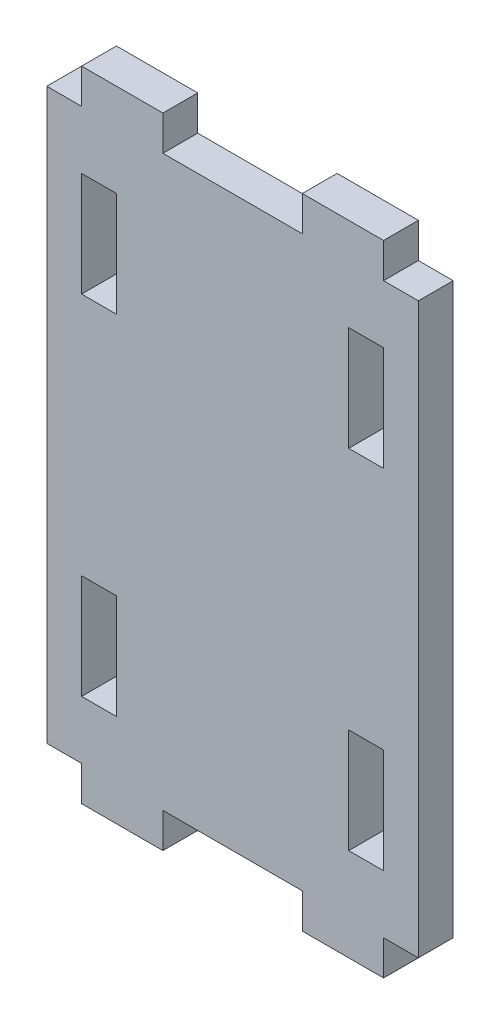
ISO-10303-21;
HEADER;
FILE_DESCRIPTION(('STEP AP214'),'2;1');
FILE_NAME('part.step','',(''),(''),'','','');
FILE_SCHEMA(('AUTOMOTIVE_DESIGN { 1 0 10303 214 1 1 1 1 }'));
ENDSEC;
DATA;
#1=APPLICATION_CONTEXT('core data for automotive mechanical design processes');
#2=APPLICATION_PROTOCOL_DEFINITION('international standard','automotive_design',2000,#1);
#3=PRODUCT_CONTEXT('',#1,'mechanical');
#4=PRODUCT('Part','Part','',(#3));
#5=PRODUCT_RELATED_PRODUCT_CATEGORY('part','',(#4));
#6=PRODUCT_DEFINITION_FORMATION('','',#4);
#7=PRODUCT_DEFINITION_CONTEXT('part definition',#1,'design');
#8=PRODUCT_DEFINITION('design','',#6,#7);
#9=PRODUCT_DEFINITION_SHAPE('','',#8);
#10=(LENGTH_UNIT() NAMED_UNIT(*) SI_UNIT(.MILLI.,.METRE.));
#11=(NAMED_UNIT(*) PLANE_ANGLE_UNIT() SI_UNIT($,.RADIAN.));
#12=(NAMED_UNIT(*) SI_UNIT($,.STERADIAN.) SOLID_ANGLE_UNIT());
#13=UNCERTAINTY_MEASURE_WITH_UNIT(LENGTH_MEASURE(1.E-05),#10,'distance_accuracy_value','');
#14=(GEOMETRIC_REPRESENTATION_CONTEXT(3) GLOBAL_UNCERTAINTY_ASSIGNED_CONTEXT((#13)) GLOBAL_UNIT_ASSIGNED_CONTEXT((#10,
#11,#12)) REPRESENTATION_CONTEXT('',''));
#15=CARTESIAN_POINT('',(0.,0.,0.));
#16=DIRECTION('',(0.,0.,1.));
#17=DIRECTION('',(1.,0.,0.));
#18=AXIS2_PLACEMENT_3D('',#15,#16,#17);
#19=CARTESIAN_POINT('',(0.,0.,3.));
#20=DIRECTION('',(1.,0.,0.));
#21=DIRECTION('',(0.,0.,-1.));
#22=AXIS2_PLACEMENT_3D('',#19,#20,#21);
#23=PLANE('',#22);
#24=DIRECTION('',(0.,0.,1.));
#25=VECTOR('',#24,1.);
#26=CARTESIAN_POINT('',(0.,3.,0.));
#27=LINE('',#26,#25);
#28=CARTESIAN_POINT('',(0.,3.,0.));
#29=VERTEX_POINT('',#28);
#30=CARTESIAN_POINT('',(0.,3.,3.));
#31=VERTEX_POINT('',#30);
#32=EDGE_CURVE('E476',#29,#31,#27,.T.);
#33=ORIENTED_EDGE('',*,*,#32,.T.);
#34=DIRECTION('',(0.,-1.,0.));
#35=VECTOR('',#34,1.);
#36=CARTESIAN_POINT('',(0.,0.,3.));
#37=LINE('',#36,#35);
#38=CARTESIAN_POINT('',(0.,52.,3.));
#39=VERTEX_POINT('',#38);
#40=EDGE_CURVE('E532',#39,#31,#37,.T.);
#41=ORIENTED_EDGE('',*,*,#40,.F.);
#42=DIRECTION('',(0.,0.,1.));
#43=VECTOR('',#42,1.);
#44=CARTESIAN_POINT('',(0.,52.,0.));
#45=LINE('',#44,#43);
#46=CARTESIAN_POINT('',(0.,52.,0.));
#47=VERTEX_POINT('',#46);
#48=EDGE_CURVE('E528',#47,#39,#45,.T.);
#49=ORIENTED_EDGE('',*,*,#48,.F.);
#50=DIRECTION('',(0.,-1.,0.));
#51=VECTOR('',#50,1.);
#52=CARTESIAN_POINT('',(0.,0.,0.));
#53=LINE('',#52,#51);
#54=EDGE_CURVE('E527',#47,#29,#53,.T.);
#55=ORIENTED_EDGE('',*,*,#54,.T.);
#56=EDGE_LOOP('',(#33,#41,#49,#55));
#57=FACE_BOUND('',#56,.T.);
#58=ADVANCED_FACE('F34',(#57),#23,.F.);
#59=CARTESIAN_POINT('',(0.,0.,3.));
#60=DIRECTION('',(0.,1.,0.));
#61=DIRECTION('',(0.,0.,1.));
#62=AXIS2_PLACEMENT_3D('',#59,#60,#61);
#63=PLANE('',#62);
#64=DIRECTION('',(1.,0.,0.));
#65=VECTOR('',#64,1.);
#66=CARTESIAN_POINT('',(0.,0.,3.));
#67=LINE('',#66,#65);
#68=CARTESIAN_POINT('',(3.,0.,3.));
#69=VERTEX_POINT('',#68);
#70=CARTESIAN_POINT('',(10.,0.,3.));
#71=VERTEX_POINT('',#70);
#72=EDGE_CURVE('E539',#69,#71,#67,.T.);
#73=ORIENTED_EDGE('',*,*,#72,.F.);
#74=DIRECTION('',(0.,0.,1.));
#75=VECTOR('',#74,1.);
#76=CARTESIAN_POINT('',(3.,0.,0.));
#77=LINE('',#76,#75);
#78=CARTESIAN_POINT('',(3.,0.,0.));
#79=VERTEX_POINT('',#78);
#80=EDGE_CURVE('E484',#79,#69,#77,.T.);
#81=ORIENTED_EDGE('',*,*,#80,.F.);
#82=DIRECTION('',(1.,0.,0.));
#83=VECTOR('',#82,1.);
#84=CARTESIAN_POINT('',(0.,0.,0.));
#85=LINE('',#84,#83);
#86=CARTESIAN_POINT('',(10.,0.,0.));
#87=VERTEX_POINT('',#86);
#88=EDGE_CURVE('E548',#79,#87,#85,.T.);
#89=ORIENTED_EDGE('',*,*,#88,.T.);
#90=DIRECTION('',(0.,0.,1.));
#91=VECTOR('',#90,1.);
#92=CARTESIAN_POINT('',(10.,0.,0.));
#93=LINE('',#92,#91);
#94=EDGE_CURVE('E497',#87,#71,#93,.T.);
#95=ORIENTED_EDGE('',*,*,#94,.T.);
#96=EDGE_LOOP('',(#73,#81,#89,#95));
#97=FACE_BOUND('',#96,.T.);
#98=ADVANCED_FACE('F560',(#97),#63,.F.);
#99=CARTESIAN_POINT('',(22.,0.,3.));
#100=VERTEX_POINT('',#99);
#101=CARTESIAN_POINT('',(29.,0.,3.));
#102=VERTEX_POINT('',#101);
#103=EDGE_CURVE('E535',#100,#102,#67,.T.);
#104=ORIENTED_EDGE('',*,*,#103,.F.);
#105=DIRECTION('',(0.,0.,1.));
#106=VECTOR('',#105,1.);
#107=CARTESIAN_POINT('',(22.,0.,0.));
#108=LINE('',#107,#106);
#109=CARTESIAN_POINT('',(22.,0.,0.));
#110=VERTEX_POINT('',#109);
#111=EDGE_CURVE('E509',#110,#100,#108,.T.);
#112=ORIENTED_EDGE('',*,*,#111,.F.);
#113=CARTESIAN_POINT('',(29.,0.,0.));
#114=VERTEX_POINT('',#113);
#115=EDGE_CURVE('E546',#110,#114,#85,.T.);
#116=ORIENTED_EDGE('',*,*,#115,.T.);
#117=DIRECTION('',(0.,0.,1.));
#118=VECTOR('',#117,1.);
#119=CARTESIAN_POINT('',(29.,0.,0.));
#120=LINE('',#119,#118);
#121=EDGE_CURVE('E410',#114,#102,#120,.T.);
#122=ORIENTED_EDGE('',*,*,#121,.T.);
#123=EDGE_LOOP('',(#104,#112,#116,#122));
#124=FACE_BOUND('',#123,.T.);
#125=ADVANCED_FACE('F629',(#124),#63,.F.);
#126=CARTESIAN_POINT('',(32.,0.,3.));
#127=DIRECTION('',(-1.,0.,0.));
#128=DIRECTION('',(0.,0.,1.));
#129=AXIS2_PLACEMENT_3D('',#126,#127,#128);
#130=PLANE('',#129);
#131=DIRECTION('',(0.,1.,0.));
#132=VECTOR('',#131,1.);
#133=CARTESIAN_POINT('',(32.,0.,0.));
#134=LINE('',#133,#132);
#135=CARTESIAN_POINT('',(32.,3.,0.));
#136=VERTEX_POINT('',#135);
#137=CARTESIAN_POINT('',(32.,52.,0.));
#138=VERTEX_POINT('',#137);
#139=EDGE_CURVE('E549',#136,#138,#134,.T.);
#140=ORIENTED_EDGE('',*,*,#139,.T.);
#141=DIRECTION('',(0.,0.,1.));
#142=VECTOR('',#141,1.);
#143=CARTESIAN_POINT('',(32.,52.,0.));
#144=LINE('',#143,#142);
#145=CARTESIAN_POINT('',(32.,52.,3.));
#146=VERTEX_POINT('',#145);
#147=EDGE_CURVE('E465',#138,#146,#144,.T.);
#148=ORIENTED_EDGE('',*,*,#147,.T.);
#149=DIRECTION('',(0.,1.,0.));
#150=VECTOR('',#149,1.);
#151=CARTESIAN_POINT('',(32.,0.,3.));
#152=LINE('',#151,#150);
#153=CARTESIAN_POINT('',(32.,3.,3.));
#154=VERTEX_POINT('',#153);
#155=EDGE_CURVE('E540',#154,#146,#152,.T.);
#156=ORIENTED_EDGE('',*,*,#155,.F.);
#157=DIRECTION('',(0.,0.,1.));
#158=VECTOR('',#157,1.);
#159=CARTESIAN_POINT('',(32.,3.,0.));
#160=LINE('',#159,#158);
#161=EDGE_CURVE('E419',#136,#154,#160,.T.);
#162=ORIENTED_EDGE('',*,*,#161,.F.);
#163=EDGE_LOOP('',(#140,#148,#156,#162));
#164=FACE_BOUND('',#163,.T.);
#165=ADVANCED_FACE('F620',(#164),#130,.F.);
#166=CARTESIAN_POINT('',(0.,55.,3.));
#167=DIRECTION('',(0.,-1.,0.));
#168=DIRECTION('',(0.,0.,-1.));
#169=AXIS2_PLACEMENT_3D('',#166,#167,#168);
#170=PLANE('',#169);
#171=DIRECTION('',(0.,0.,1.));
#172=VECTOR('',#171,1.);
#173=CARTESIAN_POINT('',(22.,55.,0.));
#174=LINE('',#173,#172);
#175=CARTESIAN_POINT('',(22.,55.,0.));
#176=VERTEX_POINT('',#175);
#177=CARTESIAN_POINT('',(22.,55.,3.));
#178=VERTEX_POINT('',#177);
#179=EDGE_CURVE('E432',#176,#178,#174,.T.);
#180=ORIENTED_EDGE('',*,*,#179,.T.);
#181=DIRECTION('',(-1.,0.,0.));
#182=VECTOR('',#181,1.);
#183=CARTESIAN_POINT('',(0.,55.,3.));
#184=LINE('',#183,#182);
#185=CARTESIAN_POINT('',(29.,55.,3.));
#186=VERTEX_POINT('',#185);
#187=EDGE_CURVE('E12',#186,#178,#184,.T.);
#188=ORIENTED_EDGE('',*,*,#187,.F.);
#189=DIRECTION('',(0.,0.,1.));
#190=VECTOR('',#189,1.);
#191=CARTESIAN_POINT('',(29.,55.,0.));
#192=LINE('',#191,#190);
#193=CARTESIAN_POINT('',(29.,55.,0.));
#194=VERTEX_POINT('',#193);
#195=EDGE_CURVE('E437',#194,#186,#192,.T.);
#196=ORIENTED_EDGE('',*,*,#195,.F.);
#197=DIRECTION('',(-1.,0.,0.));
#198=VECTOR('',#197,1.);
#199=CARTESIAN_POINT('',(0.,55.,0.));
#200=LINE('',#199,#198);
#201=EDGE_CURVE('E536',#194,#176,#200,.T.);
#202=ORIENTED_EDGE('',*,*,#201,.T.);
#203=EDGE_LOOP('',(#180,#188,#196,#202));
#204=FACE_BOUND('',#203,.T.);
#205=ADVANCED_FACE('F610',(#204),#170,.F.);
#206=CARTESIAN_POINT('',(10.,55.,3.));
#207=VERTEX_POINT('',#206);
#208=CARTESIAN_POINT('',(3.,55.,3.));
#209=VERTEX_POINT('',#208);
#210=EDGE_CURVE('E42',#207,#209,#184,.T.);
#211=ORIENTED_EDGE('',*,*,#210,.F.);
#212=DIRECTION('',(0.,0.,1.));
#213=VECTOR('',#212,1.);
#214=CARTESIAN_POINT('',(10.,55.,0.));
#215=LINE('',#214,#213);
#216=CARTESIAN_POINT('',(10.,55.,0.));
#217=VERTEX_POINT('',#216);
#218=EDGE_CURVE('E447',#217,#207,#215,.T.);
#219=ORIENTED_EDGE('',*,*,#218,.F.);
#220=CARTESIAN_POINT('',(3.,55.,0.));
#221=VERTEX_POINT('',#220);
#222=EDGE_CURVE('E37',#217,#221,#200,.T.);
#223=ORIENTED_EDGE('',*,*,#222,.T.);
#224=DIRECTION('',(0.,0.,1.));
#225=VECTOR('',#224,1.);
#226=CARTESIAN_POINT('',(3.,55.,0.));
#227=LINE('',#226,#225);
#228=EDGE_CURVE('E520',#221,#209,#227,.T.);
#229=ORIENTED_EDGE('',*,*,#228,.T.);
#230=EDGE_LOOP('',(#211,#219,#223,#229));
#231=FACE_BOUND('',#230,.T.);
#232=ADVANCED_FACE('F593',(#231),#170,.F.);
#233=CARTESIAN_POINT('',(0.,0.,3.));
#234=DIRECTION('',(0.,0.,-1.));
#235=DIRECTION('',(-1.,0.,0.));
#236=AXIS2_PLACEMENT_3D('',#233,#234,#235);
#237=PLANE('',#236);
#238=DIRECTION('',(1.,0.,0.));
#239=VECTOR('',#238,1.);
#240=CARTESIAN_POINT('',(3.,8.,3.));
#241=LINE('',#240,#239);
#242=CARTESIAN_POINT('',(3.,8.,3.));
#243=VERTEX_POINT('',#242);
#244=CARTESIAN_POINT('',(6.,8.,3.));
#245=VERTEX_POINT('',#244);
#246=EDGE_CURVE('E358',#243,#245,#241,.T.);
#247=ORIENTED_EDGE('',*,*,#246,.F.);
#248=DIRECTION('',(0.,-1.,0.));
#249=VECTOR('',#248,1.);
#250=CARTESIAN_POINT('',(3.,8.,3.));
#251=LINE('',#250,#249);
#252=CARTESIAN_POINT('',(3.,17.,3.));
#253=VERTEX_POINT('',#252);
#254=EDGE_CURVE('E50',#253,#243,#251,.T.);
#255=ORIENTED_EDGE('',*,*,#254,.F.);
#256=DIRECTION('',(-1.,0.,0.));
#257=VECTOR('',#256,1.);
#258=CARTESIAN_POINT('',(3.,17.,3.));
#259=LINE('',#258,#257);
#260=CARTESIAN_POINT('',(6.,17.,3.));
#261=VERTEX_POINT('',#260);
#262=EDGE_CURVE('E347',#261,#253,#259,.T.);
#263=ORIENTED_EDGE('',*,*,#262,.F.);
#264=DIRECTION('',(0.,1.,0.));
#265=VECTOR('',#264,1.);
#266=CARTESIAN_POINT('',(6.,8.,3.));
#267=LINE('',#266,#265);
#268=EDGE_CURVE('E361',#245,#261,#267,.T.);
#269=ORIENTED_EDGE('',*,*,#268,.F.);
#270=EDGE_LOOP('',(#247,#255,#263,#269));
#271=FACE_BOUND('',#270,.T.);
#272=DIRECTION('',(0.,1.,0.));
#273=VECTOR('',#272,1.);
#274=CARTESIAN_POINT('',(29.,8.,3.));
#275=LINE('',#274,#273);
#276=CARTESIAN_POINT('',(29.,8.,3.));
#277=VERTEX_POINT('',#276);
#278=CARTESIAN_POINT('',(29.,17.,3.));
#279=VERTEX_POINT('',#278);
#280=EDGE_CURVE('E328',#277,#279,#275,.T.);
#281=ORIENTED_EDGE('',*,*,#280,.F.);
#282=DIRECTION('',(1.,0.,0.));
#283=VECTOR('',#282,1.);
#284=CARTESIAN_POINT('',(29.,8.,3.));
#285=LINE('',#284,#283);
#286=CARTESIAN_POINT('',(26.,8.,3.));
#287=VERTEX_POINT('',#286);
#288=EDGE_CURVE('E58',#287,#277,#285,.T.);
#289=ORIENTED_EDGE('',*,*,#288,.F.);
#290=DIRECTION('',(0.,-1.,0.));
#291=VECTOR('',#290,1.);
#292=CARTESIAN_POINT('',(26.,8.,3.));
#293=LINE('',#292,#291);
#294=CARTESIAN_POINT('',(26.,17.,3.));
#295=VERTEX_POINT('',#294);
#296=EDGE_CURVE('E317',#295,#287,#293,.T.);
#297=ORIENTED_EDGE('',*,*,#296,.F.);
#298=DIRECTION('',(-1.,0.,0.));
#299=VECTOR('',#298,1.);
#300=CARTESIAN_POINT('',(29.,17.,3.));
#301=LINE('',#300,#299);
#302=EDGE_CURVE('E332',#279,#295,#301,.T.);
#303=ORIENTED_EDGE('',*,*,#302,.F.);
#304=EDGE_LOOP('',(#281,#289,#297,#303));
#305=FACE_BOUND('',#304,.T.);
#306=DIRECTION('',(-1.,0.,0.));
#307=VECTOR('',#306,1.);
#308=CARTESIAN_POINT('',(29.,47.,3.));
#309=LINE('',#308,#307);
#310=CARTESIAN_POINT('',(29.,47.,3.));
#311=VERTEX_POINT('',#310);
#312=CARTESIAN_POINT('',(26.,47.,3.));
#313=VERTEX_POINT('',#312);
#314=EDGE_CURVE('E302',#311,#313,#309,.T.);
#315=ORIENTED_EDGE('',*,*,#314,.F.);
#316=DIRECTION('',(0.,1.,0.));
#317=VECTOR('',#316,1.);
#318=CARTESIAN_POINT('',(29.,47.,3.));
#319=LINE('',#318,#317);
#320=CARTESIAN_POINT('',(29.,38.,3.));
#321=VERTEX_POINT('',#320);
#322=EDGE_CURVE('E275',#321,#311,#319,.T.);
#323=ORIENTED_EDGE('',*,*,#322,.F.);
#324=DIRECTION('',(1.,0.,0.));
#325=VECTOR('',#324,1.);
#326=CARTESIAN_POINT('',(29.,38.,3.));
#327=LINE('',#326,#325);
#328=CARTESIAN_POINT('',(26.,38.,3.));
#329=VERTEX_POINT('',#328);
#330=EDGE_CURVE('E293',#329,#321,#327,.T.);
#331=ORIENTED_EDGE('',*,*,#330,.F.);
#332=DIRECTION('',(0.,-1.,0.));
#333=VECTOR('',#332,1.);
#334=CARTESIAN_POINT('',(26.,47.,3.));
#335=LINE('',#334,#333);
#336=EDGE_CURVE('E296',#313,#329,#335,.T.);
#337=ORIENTED_EDGE('',*,*,#336,.F.);
#338=EDGE_LOOP('',(#315,#323,#331,#337));
#339=FACE_BOUND('',#338,.T.);
#340=DIRECTION('',(1.,0.,0.));
#341=VECTOR('',#340,1.);
#342=CARTESIAN_POINT('',(3.,38.,3.));
#343=LINE('',#342,#341);
#344=CARTESIAN_POINT('',(3.,38.,3.));
#345=VERTEX_POINT('',#344);
#346=CARTESIAN_POINT('',(6.,38.,3.));
#347=VERTEX_POINT('',#346);
#348=EDGE_CURVE('E387',#345,#347,#343,.T.);
#349=ORIENTED_EDGE('',*,*,#348,.F.);
#350=DIRECTION('',(0.,-1.,0.));
#351=VECTOR('',#350,1.);
#352=CARTESIAN_POINT('',(3.,47.,3.));
#353=LINE('',#352,#351);
#354=CARTESIAN_POINT('',(3.,47.,3.));
#355=VERTEX_POINT('',#354);
#356=EDGE_CURVE('E309',#355,#345,#353,.T.);
#357=ORIENTED_EDGE('',*,*,#356,.F.);
#358=DIRECTION('',(-1.,0.,0.));
#359=VECTOR('',#358,1.);
#360=CARTESIAN_POINT('',(3.,47.,3.));
#361=LINE('',#360,#359);
#362=CARTESIAN_POINT('',(6.,47.,3.));
#363=VERTEX_POINT('',#362);
#364=EDGE_CURVE('E376',#363,#355,#361,.T.);
#365=ORIENTED_EDGE('',*,*,#364,.F.);
#366=DIRECTION('',(0.,1.,0.));
#367=VECTOR('',#366,1.);
#368=CARTESIAN_POINT('',(6.,47.,3.));
#369=LINE('',#368,#367);
#370=EDGE_CURVE('E390',#347,#363,#369,.T.);
#371=ORIENTED_EDGE('',*,*,#370,.F.);
#372=EDGE_LOOP('',(#349,#357,#365,#371));
#373=FACE_BOUND('',#372,.T.);
#374=DIRECTION('',(0.,-1.,0.));
#375=VECTOR('',#374,1.);
#376=CARTESIAN_POINT('',(22.,0.,3.));
#377=LINE('',#376,#375);
#378=CARTESIAN_POINT('',(22.,52.,3.));
#379=VERTEX_POINT('',#378);
#380=EDGE_CURVE('E433',#178,#379,#377,.T.);
#381=ORIENTED_EDGE('',*,*,#380,.T.);
#382=DIRECTION('',(1.,0.,0.));
#383=VECTOR('',#382,1.);
#384=CARTESIAN_POINT('',(0.,52.,3.));
#385=LINE('',#384,#383);
#386=CARTESIAN_POINT('',(10.,52.,3.));
#387=VERTEX_POINT('',#386);
#388=EDGE_CURVE('E426',#387,#379,#385,.T.);
#389=ORIENTED_EDGE('',*,*,#388,.F.);
#390=DIRECTION('',(0.,-1.,0.));
#391=VECTOR('',#390,1.);
#392=CARTESIAN_POINT('',(10.,0.,3.));
#393=LINE('',#392,#391);
#394=EDGE_CURVE('E436',#207,#387,#393,.T.);
#395=ORIENTED_EDGE('',*,*,#394,.F.);
#396=ORIENTED_EDGE('',*,*,#210,.T.);
#397=DIRECTION('',(0.,-1.,0.));
#398=VECTOR('',#397,1.);
#399=CARTESIAN_POINT('',(3.00000000000001,0.,3.));
#400=LINE('',#399,#398);
#401=CARTESIAN_POINT('',(3.,52.,3.));
#402=VERTEX_POINT('',#401);
#403=EDGE_CURVE('E444',#209,#402,#400,.T.);
#404=ORIENTED_EDGE('',*,*,#403,.T.);
#405=DIRECTION('',(1.,0.,0.));
#406=VECTOR('',#405,1.);
#407=CARTESIAN_POINT('',(0.,52.,3.));
#408=LINE('',#407,#406);
#409=EDGE_CURVE('E517',#39,#402,#408,.T.);
#410=ORIENTED_EDGE('',*,*,#409,.F.);
#411=ORIENTED_EDGE('',*,*,#40,.T.);
#412=DIRECTION('',(1.,0.,0.));
#413=VECTOR('',#412,1.);
#414=CARTESIAN_POINT('',(0.,3.,3.));
#415=LINE('',#414,#413);
#416=CARTESIAN_POINT('',(3.,3.,3.));
#417=VERTEX_POINT('',#416);
#418=EDGE_CURVE('E477',#31,#417,#415,.T.);
#419=ORIENTED_EDGE('',*,*,#418,.T.);
#420=DIRECTION('',(0.,1.,0.));
#421=VECTOR('',#420,1.);
#422=CARTESIAN_POINT('',(3.,0.,3.));
#423=LINE('',#422,#421);
#424=EDGE_CURVE('E473',#69,#417,#423,.T.);
#425=ORIENTED_EDGE('',*,*,#424,.F.);
#426=ORIENTED_EDGE('',*,*,#72,.T.);
#427=DIRECTION('',(0.,1.,0.));
#428=VECTOR('',#427,1.);
#429=CARTESIAN_POINT('',(10.,0.,3.));
#430=LINE('',#429,#428);
#431=CARTESIAN_POINT('',(10.,3.,3.));
#432=VERTEX_POINT('',#431);
#433=EDGE_CURVE('E418',#71,#432,#430,.T.);
#434=ORIENTED_EDGE('',*,*,#433,.T.);
#435=DIRECTION('',(1.,0.,0.));
#436=VECTOR('',#435,1.);
#437=CARTESIAN_POINT('',(0.,3.,3.));
#438=LINE('',#437,#436);
#439=CARTESIAN_POINT('',(22.,3.,3.));
#440=VERTEX_POINT('',#439);
#441=EDGE_CURVE('E491',#432,#440,#438,.T.);
#442=ORIENTED_EDGE('',*,*,#441,.T.);
#443=DIRECTION('',(0.,1.,0.));
#444=VECTOR('',#443,1.);
#445=CARTESIAN_POINT('',(22.,0.,3.));
#446=LINE('',#445,#444);
#447=EDGE_CURVE('E500',#100,#440,#446,.T.);
#448=ORIENTED_EDGE('',*,*,#447,.F.);
#449=ORIENTED_EDGE('',*,*,#103,.T.);
#450=DIRECTION('',(0.,1.,0.));
#451=VECTOR('',#450,1.);
#452=CARTESIAN_POINT('',(29.,0.,3.));
#453=LINE('',#452,#451);
#454=CARTESIAN_POINT('',(29.,3.,3.));
#455=VERTEX_POINT('',#454);
#456=EDGE_CURVE('E397',#102,#455,#453,.T.);
#457=ORIENTED_EDGE('',*,*,#456,.T.);
#458=DIRECTION('',(1.,0.,0.));
#459=VECTOR('',#458,1.);
#460=CARTESIAN_POINT('',(0.,3.,3.));
#461=LINE('',#460,#459);
#462=EDGE_CURVE('E408',#455,#154,#461,.T.);
#463=ORIENTED_EDGE('',*,*,#462,.T.);
#464=ORIENTED_EDGE('',*,*,#155,.T.);
#465=DIRECTION('',(1.,0.,0.));
#466=VECTOR('',#465,1.);
#467=CARTESIAN_POINT('',(0.,52.,3.));
#468=LINE('',#467,#466);
#469=CARTESIAN_POINT('',(29.,52.,3.));
#470=VERTEX_POINT('',#469);
#471=EDGE_CURVE('E455',#470,#146,#468,.T.);
#472=ORIENTED_EDGE('',*,*,#471,.F.);
#473=DIRECTION('',(0.,-1.,0.));
#474=VECTOR('',#473,1.);
#475=CARTESIAN_POINT('',(29.,0.,3.));
#476=LINE('',#475,#474);
#477=EDGE_CURVE('E459',#186,#470,#476,.T.);
#478=ORIENTED_EDGE('',*,*,#477,.F.);
#479=ORIENTED_EDGE('',*,*,#187,.T.);
#480=EDGE_LOOP('',(#381,#389,#395,#396,#404,#410,#411,#419,#425,#426,#434,#442,#448,#449,#457,
#463,#464,#472,#478,#479));
#481=FACE_BOUND('',#480,.T.);
#482=ADVANCED_FACE('F573',(#271,#305,#339,#373,#481),#237,.F.);
#483=CARTESIAN_POINT('',(0.,0.,0.));
#484=DIRECTION('',(0.,0.,-1.));
#485=DIRECTION('',(-1.,0.,0.));
#486=AXIS2_PLACEMENT_3D('',#483,#484,#485);
#487=PLANE('',#486);
#488=DIRECTION('',(0.,-1.,0.));
#489=VECTOR('',#488,1.);
#490=CARTESIAN_POINT('',(3.,8.,0.));
#491=LINE('',#490,#489);
#492=CARTESIAN_POINT('',(3.,17.,0.));
#493=VERTEX_POINT('',#492);
#494=CARTESIAN_POINT('',(3.,8.,0.));
#495=VERTEX_POINT('',#494);
#496=EDGE_CURVE('E343',#493,#495,#491,.T.);
#497=ORIENTED_EDGE('',*,*,#496,.T.);
#498=DIRECTION('',(1.,0.,0.));
#499=VECTOR('',#498,1.);
#500=CARTESIAN_POINT('',(3.,8.,0.));
#501=LINE('',#500,#499);
#502=CARTESIAN_POINT('',(6.,8.,0.));
#503=VERTEX_POINT('',#502);
#504=EDGE_CURVE('E346',#495,#503,#501,.T.);
#505=ORIENTED_EDGE('',*,*,#504,.T.);
#506=DIRECTION('',(0.,1.,0.));
#507=VECTOR('',#506,1.);
#508=CARTESIAN_POINT('',(6.,8.,0.));
#509=LINE('',#508,#507);
#510=CARTESIAN_POINT('',(6.,17.,0.));
#511=VERTEX_POINT('',#510);
#512=EDGE_CURVE('E350',#503,#511,#509,.T.);
#513=ORIENTED_EDGE('',*,*,#512,.T.);
#514=DIRECTION('',(-1.,0.,0.));
#515=VECTOR('',#514,1.);
#516=CARTESIAN_POINT('',(3.,17.,0.));
#517=LINE('',#516,#515);
#518=EDGE_CURVE('E353',#511,#493,#517,.T.);
#519=ORIENTED_EDGE('',*,*,#518,.T.);
#520=EDGE_LOOP('',(#497,#505,#513,#519));
#521=FACE_BOUND('',#520,.T.);
#522=DIRECTION('',(1.,0.,0.));
#523=VECTOR('',#522,1.);
#524=CARTESIAN_POINT('',(29.,8.,0.));
#525=LINE('',#524,#523);
#526=CARTESIAN_POINT('',(26.,8.,0.));
#527=VERTEX_POINT('',#526);
#528=CARTESIAN_POINT('',(29.,8.,0.));
#529=VERTEX_POINT('',#528);
#530=EDGE_CURVE('E313',#527,#529,#525,.T.);
#531=ORIENTED_EDGE('',*,*,#530,.T.);
#532=DIRECTION('',(0.,1.,0.));
#533=VECTOR('',#532,1.);
#534=CARTESIAN_POINT('',(29.,8.,0.));
#535=LINE('',#534,#533);
#536=CARTESIAN_POINT('',(29.,17.,0.));
#537=VERTEX_POINT('',#536);
#538=EDGE_CURVE('E316',#529,#537,#535,.T.);
#539=ORIENTED_EDGE('',*,*,#538,.T.);
#540=DIRECTION('',(-1.,0.,0.));
#541=VECTOR('',#540,1.);
#542=CARTESIAN_POINT('',(29.,17.,0.));
#543=LINE('',#542,#541);
#544=CARTESIAN_POINT('',(26.,17.,0.));
#545=VERTEX_POINT('',#544);
#546=EDGE_CURVE('E320',#537,#545,#543,.T.);
#547=ORIENTED_EDGE('',*,*,#546,.T.);
#548=DIRECTION('',(0.,-1.,0.));
#549=VECTOR('',#548,1.);
#550=CARTESIAN_POINT('',(26.,8.,0.));
#551=LINE('',#550,#549);
#552=EDGE_CURVE('E323',#545,#527,#551,.T.);
#553=ORIENTED_EDGE('',*,*,#552,.T.);
#554=EDGE_LOOP('',(#531,#539,#547,#553));
#555=FACE_BOUND('',#554,.T.);
#556=DIRECTION('',(0.,1.,0.));
#557=VECTOR('',#556,1.);
#558=CARTESIAN_POINT('',(29.,47.,0.));
#559=LINE('',#558,#557);
#560=CARTESIAN_POINT('',(29.,38.,0.));
#561=VERTEX_POINT('',#560);
#562=CARTESIAN_POINT('',(29.,47.,0.));
#563=VERTEX_POINT('',#562);
#564=EDGE_CURVE('E272',#561,#563,#559,.T.);
#565=ORIENTED_EDGE('',*,*,#564,.T.);
#566=DIRECTION('',(-1.,0.,0.));
#567=VECTOR('',#566,1.);
#568=CARTESIAN_POINT('',(29.,47.,0.));
#569=LINE('',#568,#567);
#570=CARTESIAN_POINT('',(26.,47.,0.));
#571=VERTEX_POINT('',#570);
#572=EDGE_CURVE('E284',#563,#571,#569,.T.);
#573=ORIENTED_EDGE('',*,*,#572,.T.);
#574=DIRECTION('',(0.,-1.,0.));
#575=VECTOR('',#574,1.);
#576=CARTESIAN_POINT('',(26.,47.,0.));
#577=LINE('',#576,#575);
#578=CARTESIAN_POINT('',(26.,38.,0.));
#579=VERTEX_POINT('',#578);
#580=EDGE_CURVE('E288',#571,#579,#577,.T.);
#581=ORIENTED_EDGE('',*,*,#580,.T.);
#582=DIRECTION('',(1.,0.,0.));
#583=VECTOR('',#582,1.);
#584=CARTESIAN_POINT('',(29.,38.,0.));
#585=LINE('',#584,#583);
#586=EDGE_CURVE('E280',#579,#561,#585,.T.);
#587=ORIENTED_EDGE('',*,*,#586,.T.);
#588=EDGE_LOOP('',(#565,#573,#581,#587));
#589=FACE_BOUND('',#588,.T.);
#590=DIRECTION('',(0.,-1.,0.));
#591=VECTOR('',#590,1.);
#592=CARTESIAN_POINT('',(3.,47.,0.));
#593=LINE('',#592,#591);
#594=CARTESIAN_POINT('',(3.,47.,0.));
#595=VERTEX_POINT('',#594);
#596=CARTESIAN_POINT('',(3.,38.,0.));
#597=VERTEX_POINT('',#596);
#598=EDGE_CURVE('E372',#595,#597,#593,.T.);
#599=ORIENTED_EDGE('',*,*,#598,.T.);
#600=DIRECTION('',(1.,0.,0.));
#601=VECTOR('',#600,1.);
#602=CARTESIAN_POINT('',(3.,38.,0.));
#603=LINE('',#602,#601);
#604=CARTESIAN_POINT('',(6.,38.,0.));
#605=VERTEX_POINT('',#604);
#606=EDGE_CURVE('E375',#597,#605,#603,.T.);
#607=ORIENTED_EDGE('',*,*,#606,.T.);
#608=DIRECTION('',(0.,1.,0.));
#609=VECTOR('',#608,1.);
#610=CARTESIAN_POINT('',(6.,47.,0.));
#611=LINE('',#610,#609);
#612=CARTESIAN_POINT('',(6.,47.,0.));
#613=VERTEX_POINT('',#612);
#614=EDGE_CURVE('E379',#605,#613,#611,.T.);
#615=ORIENTED_EDGE('',*,*,#614,.T.);
#616=DIRECTION('',(-1.,0.,0.));
#617=VECTOR('',#616,1.);
#618=CARTESIAN_POINT('',(3.,47.,0.));
#619=LINE('',#618,#617);
#620=EDGE_CURVE('E382',#613,#595,#619,.T.);
#621=ORIENTED_EDGE('',*,*,#620,.T.);
#622=EDGE_LOOP('',(#599,#607,#615,#621));
#623=FACE_BOUND('',#622,.T.);
#624=DIRECTION('',(1.,0.,0.));
#625=VECTOR('',#624,1.);
#626=CARTESIAN_POINT('',(0.,52.,0.));
#627=LINE('',#626,#625);
#628=CARTESIAN_POINT('',(10.,52.,0.));
#629=VERTEX_POINT('',#628);
#630=CARTESIAN_POINT('',(22.,52.,0.));
#631=VERTEX_POINT('',#630);
#632=EDGE_CURVE('E429',#629,#631,#627,.T.);
#633=ORIENTED_EDGE('',*,*,#632,.T.);
#634=DIRECTION('',(0.,-1.,0.));
#635=VECTOR('',#634,1.);
#636=CARTESIAN_POINT('',(22.,0.,0.));
#637=LINE('',#636,#635);
#638=EDGE_CURVE('E423',#176,#631,#637,.T.);
#639=ORIENTED_EDGE('',*,*,#638,.F.);
#640=ORIENTED_EDGE('',*,*,#201,.F.);
#641=DIRECTION('',(0.,-1.,0.));
#642=VECTOR('',#641,1.);
#643=CARTESIAN_POINT('',(29.,0.,0.));
#644=LINE('',#643,#642);
#645=CARTESIAN_POINT('',(29.,52.,0.));
#646=VERTEX_POINT('',#645);
#647=EDGE_CURVE('E451',#194,#646,#644,.T.);
#648=ORIENTED_EDGE('',*,*,#647,.T.);
#649=DIRECTION('',(1.,0.,0.));
#650=VECTOR('',#649,1.);
#651=CARTESIAN_POINT('',(0.,52.,0.));
#652=LINE('',#651,#650);
#653=EDGE_CURVE('E454',#646,#138,#652,.T.);
#654=ORIENTED_EDGE('',*,*,#653,.T.);
#655=ORIENTED_EDGE('',*,*,#139,.F.);
#656=DIRECTION('',(1.,0.,0.));
#657=VECTOR('',#656,1.);
#658=CARTESIAN_POINT('',(0.,3.,0.));
#659=LINE('',#658,#657);
#660=CARTESIAN_POINT('',(29.,3.,0.));
#661=VERTEX_POINT('',#660);
#662=EDGE_CURVE('E407',#661,#136,#659,.T.);
#663=ORIENTED_EDGE('',*,*,#662,.F.);
#664=DIRECTION('',(0.,1.,0.));
#665=VECTOR('',#664,1.);
#666=CARTESIAN_POINT('',(29.,0.,0.));
#667=LINE('',#666,#665);
#668=EDGE_CURVE('E404',#114,#661,#667,.T.);
#669=ORIENTED_EDGE('',*,*,#668,.F.);
#670=ORIENTED_EDGE('',*,*,#115,.F.);
#671=DIRECTION('',(0.,1.,0.));
#672=VECTOR('',#671,1.);
#673=CARTESIAN_POINT('',(22.,0.,0.));
#674=LINE('',#673,#672);
#675=CARTESIAN_POINT('',(22.,3.,0.));
#676=VERTEX_POINT('',#675);
#677=EDGE_CURVE('E490',#110,#676,#674,.T.);
#678=ORIENTED_EDGE('',*,*,#677,.T.);
#679=DIRECTION('',(1.,0.,0.));
#680=VECTOR('',#679,1.);
#681=CARTESIAN_POINT('',(0.,3.,0.));
#682=LINE('',#681,#680);
#683=CARTESIAN_POINT('',(10.,3.,0.));
#684=VERTEX_POINT('',#683);
#685=EDGE_CURVE('E494',#684,#676,#682,.T.);
#686=ORIENTED_EDGE('',*,*,#685,.F.);
#687=DIRECTION('',(0.,1.,0.));
#688=VECTOR('',#687,1.);
#689=CARTESIAN_POINT('',(10.,0.,0.));
#690=LINE('',#689,#688);
#691=EDGE_CURVE('E488',#87,#684,#690,.T.);
#692=ORIENTED_EDGE('',*,*,#691,.F.);
#693=ORIENTED_EDGE('',*,*,#88,.F.);
#694=DIRECTION('',(0.,1.,0.));
#695=VECTOR('',#694,1.);
#696=CARTESIAN_POINT('',(3.,0.,0.));
#697=LINE('',#696,#695);
#698=CARTESIAN_POINT('',(3.,3.,0.));
#699=VERTEX_POINT('',#698);
#700=EDGE_CURVE('E472',#79,#699,#697,.T.);
#701=ORIENTED_EDGE('',*,*,#700,.T.);
#702=DIRECTION('',(1.,0.,0.));
#703=VECTOR('',#702,1.);
#704=CARTESIAN_POINT('',(0.,3.,0.));
#705=LINE('',#704,#703);
#706=EDGE_CURVE('E469',#29,#699,#705,.T.);
#707=ORIENTED_EDGE('',*,*,#706,.F.);
#708=ORIENTED_EDGE('',*,*,#54,.F.);
#709=DIRECTION('',(1.,0.,0.));
#710=VECTOR('',#709,1.);
#711=CARTESIAN_POINT('',(0.,52.,0.));
#712=LINE('',#711,#710);
#713=CARTESIAN_POINT('',(3.,52.,0.));
#714=VERTEX_POINT('',#713);
#715=EDGE_CURVE('E516',#47,#714,#712,.T.);
#716=ORIENTED_EDGE('',*,*,#715,.T.);
#717=DIRECTION('',(0.,-1.,0.));
#718=VECTOR('',#717,1.);
#719=CARTESIAN_POINT('',(3.00000000000001,0.,0.));
#720=LINE('',#719,#718);
#721=EDGE_CURVE('E513',#221,#714,#720,.T.);
#722=ORIENTED_EDGE('',*,*,#721,.F.);
#723=ORIENTED_EDGE('',*,*,#222,.F.);
#724=DIRECTION('',(0.,-1.,0.));
#725=VECTOR('',#724,1.);
#726=CARTESIAN_POINT('',(10.,0.,0.));
#727=LINE('',#726,#725);
#728=EDGE_CURVE('E425',#217,#629,#727,.T.);
#729=ORIENTED_EDGE('',*,*,#728,.T.);
#730=EDGE_LOOP('',(#633,#639,#640,#648,#654,#655,#663,#669,#670,#678,#686,#692,#693,#701,#707,
#708,#716,#722,#723,#729));
#731=FACE_BOUND('',#730,.T.);
#732=ADVANCED_FACE('F290',(#521,#555,#589,#623,#731),#487,.T.);
#733=CARTESIAN_POINT('',(3.00000000000001,0.,0.));
#734=DIRECTION('',(-1.,0.,0.));
#735=DIRECTION('',(0.,-1.,0.));
#736=AXIS2_PLACEMENT_3D('',#733,#734,#735);
#737=PLANE('',#736);
#738=ORIENTED_EDGE('',*,*,#403,.F.);
#739=ORIENTED_EDGE('',*,*,#228,.F.);
#740=ORIENTED_EDGE('',*,*,#721,.T.);
#741=DIRECTION('',(0.,0.,1.));
#742=VECTOR('',#741,1.);
#743=CARTESIAN_POINT('',(3.,52.,0.));
#744=LINE('',#743,#742);
#745=EDGE_CURVE('E525',#714,#402,#744,.T.);
#746=ORIENTED_EDGE('',*,*,#745,.T.);
#747=EDGE_LOOP('',(#738,#739,#740,#746));
#748=FACE_BOUND('',#747,.T.);
#749=ADVANCED_FACE('F590',(#748),#737,.T.);
#750=CARTESIAN_POINT('',(0.,52.,0.));
#751=DIRECTION('',(0.,-1.,0.));
#752=DIRECTION('',(0.,0.,-1.));
#753=AXIS2_PLACEMENT_3D('',#750,#751,#752);
#754=PLANE('',#753);
#755=ORIENTED_EDGE('',*,*,#409,.T.);
#756=ORIENTED_EDGE('',*,*,#745,.F.);
#757=ORIENTED_EDGE('',*,*,#715,.F.);
#758=ORIENTED_EDGE('',*,*,#48,.T.);
#759=EDGE_LOOP('',(#755,#756,#757,#758));
#760=FACE_BOUND('',#759,.T.);
#761=ADVANCED_FACE('F586',(#760),#754,.F.);
#762=CARTESIAN_POINT('',(29.,0.,0.));
#763=DIRECTION('',(1.,0.,0.));
#764=DIRECTION('',(0.,0.,-1.));
#765=AXIS2_PLACEMENT_3D('',#762,#763,#764);
#766=PLANE('',#765);
#767=ORIENTED_EDGE('',*,*,#456,.F.);
#768=ORIENTED_EDGE('',*,*,#121,.F.);
#769=ORIENTED_EDGE('',*,*,#668,.T.);
#770=DIRECTION('',(0.,0.,1.));
#771=VECTOR('',#770,1.);
#772=CARTESIAN_POINT('',(29.,3.,0.));
#773=LINE('',#772,#771);
#774=EDGE_CURVE('E415',#661,#455,#773,.T.);
#775=ORIENTED_EDGE('',*,*,#774,.T.);
#776=EDGE_LOOP('',(#767,#768,#769,#775));
#777=FACE_BOUND('',#776,.T.);
#778=ADVANCED_FACE('F627',(#777),#766,.T.);
#779=CARTESIAN_POINT('',(0.,3.,0.));
#780=DIRECTION('',(0.,-1.,0.));
#781=DIRECTION('',(0.,0.,-1.));
#782=AXIS2_PLACEMENT_3D('',#779,#780,#781);
#783=PLANE('',#782);
#784=ORIENTED_EDGE('',*,*,#462,.F.);
#785=ORIENTED_EDGE('',*,*,#774,.F.);
#786=ORIENTED_EDGE('',*,*,#662,.T.);
#787=ORIENTED_EDGE('',*,*,#161,.T.);
#788=EDGE_LOOP('',(#784,#785,#786,#787));
#789=FACE_BOUND('',#788,.T.);
#790=ADVANCED_FACE('F625',(#789),#783,.T.);
#791=CARTESIAN_POINT('',(10.,0.,0.));
#792=DIRECTION('',(1.,0.,0.));
#793=DIRECTION('',(0.,1.,0.));
#794=AXIS2_PLACEMENT_3D('',#791,#792,#793);
#795=PLANE('',#794);
#796=ORIENTED_EDGE('',*,*,#433,.F.);
#797=ORIENTED_EDGE('',*,*,#94,.F.);
#798=ORIENTED_EDGE('',*,*,#691,.T.);
#799=DIRECTION('',(0.,0.,1.));
#800=VECTOR('',#799,1.);
#801=CARTESIAN_POINT('',(10.,3.,0.));
#802=LINE('',#801,#800);
#803=EDGE_CURVE('E480',#684,#432,#802,.T.);
#804=ORIENTED_EDGE('',*,*,#803,.T.);
#805=EDGE_LOOP('',(#796,#797,#798,#804));
#806=FACE_BOUND('',#805,.T.);
#807=ADVANCED_FACE('F568',(#806),#795,.T.);
#808=CARTESIAN_POINT('',(0.,3.,0.));
#809=DIRECTION('',(0.,-1.,0.));
#810=DIRECTION('',(0.,0.,-1.));
#811=AXIS2_PLACEMENT_3D('',#808,#809,#810);
#812=PLANE('',#811);
#813=ORIENTED_EDGE('',*,*,#441,.F.);
#814=ORIENTED_EDGE('',*,*,#803,.F.);
#815=ORIENTED_EDGE('',*,*,#685,.T.);
#816=DIRECTION('',(0.,0.,1.));
#817=VECTOR('',#816,1.);
#818=CARTESIAN_POINT('',(22.,3.,0.));
#819=LINE('',#818,#817);
#820=EDGE_CURVE('E507',#676,#440,#819,.T.);
#821=ORIENTED_EDGE('',*,*,#820,.T.);
#822=EDGE_LOOP('',(#813,#814,#815,#821));
#823=FACE_BOUND('',#822,.T.);
#824=ADVANCED_FACE('F570',(#823),#812,.T.);
#825=CARTESIAN_POINT('',(22.,0.,0.));
#826=DIRECTION('',(1.,0.,0.));
#827=DIRECTION('',(0.,0.,-1.));
#828=AXIS2_PLACEMENT_3D('',#825,#826,#827);
#829=PLANE('',#828);
#830=ORIENTED_EDGE('',*,*,#447,.T.);
#831=ORIENTED_EDGE('',*,*,#820,.F.);
#832=ORIENTED_EDGE('',*,*,#677,.F.);
#833=ORIENTED_EDGE('',*,*,#111,.T.);
#834=EDGE_LOOP('',(#830,#831,#832,#833));
#835=FACE_BOUND('',#834,.T.);
#836=ADVANCED_FACE('F632',(#835),#829,.F.);
#837=CARTESIAN_POINT('',(0.,3.,0.));
#838=DIRECTION('',(0.,-1.,0.));
#839=DIRECTION('',(0.,0.,-1.));
#840=AXIS2_PLACEMENT_3D('',#837,#838,#839);
#841=PLANE('',#840);
#842=ORIENTED_EDGE('',*,*,#418,.F.);
#843=ORIENTED_EDGE('',*,*,#32,.F.);
#844=ORIENTED_EDGE('',*,*,#706,.T.);
#845=DIRECTION('',(0.,0.,1.));
#846=VECTOR('',#845,1.);
#847=CARTESIAN_POINT('',(3.,3.,0.));
#848=LINE('',#847,#846);
#849=EDGE_CURVE('E462',#699,#417,#848,.T.);
#850=ORIENTED_EDGE('',*,*,#849,.T.);
#851=EDGE_LOOP('',(#842,#843,#844,#850));
#852=FACE_BOUND('',#851,.T.);
#853=ADVANCED_FACE('F579',(#852),#841,.T.);
#854=CARTESIAN_POINT('',(3.,0.,0.));
#855=DIRECTION('',(1.,0.,0.));
#856=DIRECTION('',(0.,1.,0.));
#857=AXIS2_PLACEMENT_3D('',#854,#855,#856);
#858=PLANE('',#857);
#859=ORIENTED_EDGE('',*,*,#424,.T.);
#860=ORIENTED_EDGE('',*,*,#849,.F.);
#861=ORIENTED_EDGE('',*,*,#700,.F.);
#862=ORIENTED_EDGE('',*,*,#80,.T.);
#863=EDGE_LOOP('',(#859,#860,#861,#862));
#864=FACE_BOUND('',#863,.T.);
#865=ADVANCED_FACE('F577',(#864),#858,.F.);
#866=CARTESIAN_POINT('',(29.,0.,0.));
#867=DIRECTION('',(-1.,0.,0.));
#868=DIRECTION('',(0.,0.,1.));
#869=AXIS2_PLACEMENT_3D('',#866,#867,#868);
#870=PLANE('',#869);
#871=ORIENTED_EDGE('',*,*,#477,.T.);
#872=DIRECTION('',(0.,0.,1.));
#873=VECTOR('',#872,1.);
#874=CARTESIAN_POINT('',(29.,52.,0.));
#875=LINE('',#874,#873);
#876=EDGE_CURVE('E458',#646,#470,#875,.T.);
#877=ORIENTED_EDGE('',*,*,#876,.F.);
#878=ORIENTED_EDGE('',*,*,#647,.F.);
#879=ORIENTED_EDGE('',*,*,#195,.T.);
#880=EDGE_LOOP('',(#871,#877,#878,#879));
#881=FACE_BOUND('',#880,.T.);
#882=ADVANCED_FACE('F614',(#881),#870,.F.);
#883=CARTESIAN_POINT('',(0.,52.,0.));
#884=DIRECTION('',(0.,-1.,0.));
#885=DIRECTION('',(0.,0.,-1.));
#886=AXIS2_PLACEMENT_3D('',#883,#884,#885);
#887=PLANE('',#886);
#888=ORIENTED_EDGE('',*,*,#471,.T.);
#889=ORIENTED_EDGE('',*,*,#147,.F.);
#890=ORIENTED_EDGE('',*,*,#653,.F.);
#891=ORIENTED_EDGE('',*,*,#876,.T.);
#892=EDGE_LOOP('',(#888,#889,#890,#891));
#893=FACE_BOUND('',#892,.T.);
#894=ADVANCED_FACE('F618',(#893),#887,.F.);
#895=CARTESIAN_POINT('',(22.,0.,0.));
#896=DIRECTION('',(-1.,0.,0.));
#897=DIRECTION('',(0.,0.,1.));
#898=AXIS2_PLACEMENT_3D('',#895,#896,#897);
#899=PLANE('',#898);
#900=ORIENTED_EDGE('',*,*,#380,.F.);
#901=ORIENTED_EDGE('',*,*,#179,.F.);
#902=ORIENTED_EDGE('',*,*,#638,.T.);
#903=DIRECTION('',(0.,0.,1.));
#904=VECTOR('',#903,1.);
#905=CARTESIAN_POINT('',(22.,52.,0.));
#906=LINE('',#905,#904);
#907=EDGE_CURVE('E442',#631,#379,#906,.T.);
#908=ORIENTED_EDGE('',*,*,#907,.T.);
#909=EDGE_LOOP('',(#900,#901,#902,#908));
#910=FACE_BOUND('',#909,.T.);
#911=ADVANCED_FACE('F605',(#910),#899,.T.);
#912=CARTESIAN_POINT('',(0.,52.,0.));
#913=DIRECTION('',(0.,-1.,0.));
#914=DIRECTION('',(0.,0.,-1.));
#915=AXIS2_PLACEMENT_3D('',#912,#913,#914);
#916=PLANE('',#915);
#917=ORIENTED_EDGE('',*,*,#388,.T.);
#918=ORIENTED_EDGE('',*,*,#907,.F.);
#919=ORIENTED_EDGE('',*,*,#632,.F.);
#920=DIRECTION('',(0.,0.,1.));
#921=VECTOR('',#920,1.);
#922=CARTESIAN_POINT('',(10.,52.,0.));
#923=LINE('',#922,#921);
#924=EDGE_CURVE('E445',#629,#387,#923,.T.);
#925=ORIENTED_EDGE('',*,*,#924,.T.);
#926=EDGE_LOOP('',(#917,#918,#919,#925));
#927=FACE_BOUND('',#926,.T.);
#928=ADVANCED_FACE('F602',(#927),#916,.F.);
#929=CARTESIAN_POINT('',(10.,0.,0.));
#930=DIRECTION('',(-1.,0.,0.));
#931=DIRECTION('',(0.,-1.,0.));
#932=AXIS2_PLACEMENT_3D('',#929,#930,#931);
#933=PLANE('',#932);
#934=ORIENTED_EDGE('',*,*,#394,.T.);
#935=ORIENTED_EDGE('',*,*,#924,.F.);
#936=ORIENTED_EDGE('',*,*,#728,.F.);
#937=ORIENTED_EDGE('',*,*,#218,.T.);
#938=EDGE_LOOP('',(#934,#935,#936,#937));
#939=FACE_BOUND('',#938,.T.);
#940=ADVANCED_FACE('F599',(#939),#933,.F.);
#941=CARTESIAN_POINT('',(3.,47.,0.));
#942=DIRECTION('',(-1.,0.,0.));
#943=DIRECTION('',(0.,-1.,0.));
#944=AXIS2_PLACEMENT_3D('',#941,#942,#943);
#945=PLANE('',#944);
#946=ORIENTED_EDGE('',*,*,#356,.T.);
#947=DIRECTION('',(0.,0.,1.));
#948=VECTOR('',#947,1.);
#949=CARTESIAN_POINT('',(3.,38.,0.));
#950=LINE('',#949,#948);
#951=EDGE_CURVE('E385',#597,#345,#950,.T.);
#952=ORIENTED_EDGE('',*,*,#951,.F.);
#953=ORIENTED_EDGE('',*,*,#598,.F.);
#954=DIRECTION('',(0.,0.,1.));
#955=VECTOR('',#954,1.);
#956=CARTESIAN_POINT('',(3.,47.,0.));
#957=LINE('',#956,#955);
#958=EDGE_CURVE('E395',#595,#355,#957,.T.);
#959=ORIENTED_EDGE('',*,*,#958,.T.);
#960=EDGE_LOOP('',(#946,#952,#953,#959));
#961=FACE_BOUND('',#960,.T.);
#962=ADVANCED_FACE('F673',(#961),#945,.F.);
#963=CARTESIAN_POINT('',(3.,47.,0.));
#964=DIRECTION('',(0.,1.,0.));
#965=DIRECTION('',(0.,0.,1.));
#966=AXIS2_PLACEMENT_3D('',#963,#964,#965);
#967=PLANE('',#966);
#968=ORIENTED_EDGE('',*,*,#364,.T.);
#969=ORIENTED_EDGE('',*,*,#958,.F.);
#970=ORIENTED_EDGE('',*,*,#620,.F.);
#971=DIRECTION('',(0.,0.,1.));
#972=VECTOR('',#971,1.);
#973=CARTESIAN_POINT('',(6.,47.,0.));
#974=LINE('',#973,#972);
#975=EDGE_CURVE('E398',#613,#363,#974,.T.);
#976=ORIENTED_EDGE('',*,*,#975,.T.);
#977=EDGE_LOOP('',(#968,#969,#970,#976));
#978=FACE_BOUND('',#977,.T.);
#979=ADVANCED_FACE('F718',(#978),#967,.F.);
#980=CARTESIAN_POINT('',(6.,47.,0.));
#981=DIRECTION('',(1.,0.,0.));
#982=DIRECTION('',(0.,1.,0.));
#983=AXIS2_PLACEMENT_3D('',#980,#981,#982);
#984=PLANE('',#983);
#985=ORIENTED_EDGE('',*,*,#370,.T.);
#986=ORIENTED_EDGE('',*,*,#975,.F.);
#987=ORIENTED_EDGE('',*,*,#614,.F.);
#988=DIRECTION('',(0.,0.,1.));
#989=VECTOR('',#988,1.);
#990=CARTESIAN_POINT('',(6.,38.,0.));
#991=LINE('',#990,#989);
#992=EDGE_CURVE('E400',#605,#347,#991,.T.);
#993=ORIENTED_EDGE('',*,*,#992,.T.);
#994=EDGE_LOOP('',(#985,#986,#987,#993));
#995=FACE_BOUND('',#994,.T.);
#996=ADVANCED_FACE('F726',(#995),#984,.F.);
#997=CARTESIAN_POINT('',(3.,38.,0.));
#998=DIRECTION('',(0.,-1.,0.));
#999=DIRECTION('',(0.,0.,-1.));
#1000=AXIS2_PLACEMENT_3D('',#997,#998,#999);
#1001=PLANE('',#1000);
#1002=ORIENTED_EDGE('',*,*,#348,.T.);
#1003=ORIENTED_EDGE('',*,*,#992,.F.);
#1004=ORIENTED_EDGE('',*,*,#606,.F.);
#1005=ORIENTED_EDGE('',*,*,#951,.T.);
#1006=EDGE_LOOP('',(#1002,#1003,#1004,#1005));
#1007=FACE_BOUND('',#1006,.T.);
#1008=ADVANCED_FACE('F734',(#1007),#1001,.F.);
#1009=CARTESIAN_POINT('',(29.,47.,0.));
#1010=DIRECTION('',(1.,0.,0.));
#1011=DIRECTION('',(0.,1.,0.));
#1012=AXIS2_PLACEMENT_3D('',#1009,#1010,#1011);
#1013=PLANE('',#1012);
#1014=ORIENTED_EDGE('',*,*,#322,.T.);
#1015=DIRECTION('',(0.,0.,1.));
#1016=VECTOR('',#1015,1.);
#1017=CARTESIAN_POINT('',(29.,47.,0.));
#1018=LINE('',#1017,#1016);
#1019=EDGE_CURVE('E268',#563,#311,#1018,.T.);
#1020=ORIENTED_EDGE('',*,*,#1019,.F.);
#1021=ORIENTED_EDGE('',*,*,#564,.F.);
#1022=DIRECTION('',(0.,0.,1.));
#1023=VECTOR('',#1022,1.);
#1024=CARTESIAN_POINT('',(29.,38.,0.));
#1025=LINE('',#1024,#1023);
#1026=EDGE_CURVE('E307',#561,#321,#1025,.T.);
#1027=ORIENTED_EDGE('',*,*,#1026,.T.);
#1028=EDGE_LOOP('',(#1014,#1020,#1021,#1027));
#1029=FACE_BOUND('',#1028,.T.);
#1030=ADVANCED_FACE('F270',(#1029),#1013,.F.);
#1031=CARTESIAN_POINT('',(29.,38.,0.));
#1032=DIRECTION('',(0.,-1.,0.));
#1033=DIRECTION('',(0.,0.,-1.));
#1034=AXIS2_PLACEMENT_3D('',#1031,#1032,#1033);
#1035=PLANE('',#1034);
#1036=ORIENTED_EDGE('',*,*,#330,.T.);
#1037=ORIENTED_EDGE('',*,*,#1026,.F.);
#1038=ORIENTED_EDGE('',*,*,#586,.F.);
#1039=DIRECTION('',(0.,0.,1.));
#1040=VECTOR('',#1039,1.);
#1041=CARTESIAN_POINT('',(26.,38.,0.));
#1042=LINE('',#1041,#1040);
#1043=EDGE_CURVE('E310',#579,#329,#1042,.T.);
#1044=ORIENTED_EDGE('',*,*,#1043,.T.);
#1045=EDGE_LOOP('',(#1036,#1037,#1038,#1044));
#1046=FACE_BOUND('',#1045,.T.);
#1047=ADVANCED_FACE('F748',(#1046),#1035,.F.);
#1048=CARTESIAN_POINT('',(26.,47.,0.));
#1049=DIRECTION('',(-1.,0.,0.));
#1050=DIRECTION('',(0.,-1.,0.));
#1051=AXIS2_PLACEMENT_3D('',#1048,#1049,#1050);
#1052=PLANE('',#1051);
#1053=ORIENTED_EDGE('',*,*,#336,.T.);
#1054=ORIENTED_EDGE('',*,*,#1043,.F.);
#1055=ORIENTED_EDGE('',*,*,#580,.F.);
#1056=DIRECTION('',(0.,0.,1.));
#1057=VECTOR('',#1056,1.);
#1058=CARTESIAN_POINT('',(26.,47.,0.));
#1059=LINE('',#1058,#1057);
#1060=EDGE_CURVE('E279',#571,#313,#1059,.T.);
#1061=ORIENTED_EDGE('',*,*,#1060,.T.);
#1062=EDGE_LOOP('',(#1053,#1054,#1055,#1061));
#1063=FACE_BOUND('',#1062,.T.);
#1064=ADVANCED_FACE('F755',(#1063),#1052,.F.);
#1065=CARTESIAN_POINT('',(29.,47.,0.));
#1066=DIRECTION('',(0.,1.,0.));
#1067=DIRECTION('',(0.,0.,1.));
#1068=AXIS2_PLACEMENT_3D('',#1065,#1066,#1067);
#1069=PLANE('',#1068);
#1070=ORIENTED_EDGE('',*,*,#314,.T.);
#1071=ORIENTED_EDGE('',*,*,#1060,.F.);
#1072=ORIENTED_EDGE('',*,*,#572,.F.);
#1073=ORIENTED_EDGE('',*,*,#1019,.T.);
#1074=EDGE_LOOP('',(#1070,#1071,#1072,#1073));
#1075=FACE_BOUND('',#1074,.T.);
#1076=ADVANCED_FACE('F285',(#1075),#1069,.F.);
#1077=CARTESIAN_POINT('',(29.,8.,0.));
#1078=DIRECTION('',(0.,-1.,0.));
#1079=DIRECTION('',(0.,0.,-1.));
#1080=AXIS2_PLACEMENT_3D('',#1077,#1078,#1079);
#1081=PLANE('',#1080);
#1082=ORIENTED_EDGE('',*,*,#288,.T.);
#1083=DIRECTION('',(0.,0.,1.));
#1084=VECTOR('',#1083,1.);
#1085=CARTESIAN_POINT('',(29.,8.,0.));
#1086=LINE('',#1085,#1084);
#1087=EDGE_CURVE('E326',#529,#277,#1086,.T.);
#1088=ORIENTED_EDGE('',*,*,#1087,.F.);
#1089=ORIENTED_EDGE('',*,*,#530,.F.);
#1090=DIRECTION('',(0.,0.,1.));
#1091=VECTOR('',#1090,1.);
#1092=CARTESIAN_POINT('',(26.,8.,0.));
#1093=LINE('',#1092,#1091);
#1094=EDGE_CURVE('E303',#527,#287,#1093,.T.);
#1095=ORIENTED_EDGE('',*,*,#1094,.T.);
#1096=EDGE_LOOP('',(#1082,#1088,#1089,#1095));
#1097=FACE_BOUND('',#1096,.T.);
#1098=ADVANCED_FACE('F770',(#1097),#1081,.F.);
#1099=CARTESIAN_POINT('',(26.,8.,0.));
#1100=DIRECTION('',(-1.,0.,0.));
#1101=DIRECTION('',(0.,-1.,0.));
#1102=AXIS2_PLACEMENT_3D('',#1099,#1100,#1101);
#1103=PLANE('',#1102);
#1104=ORIENTED_EDGE('',*,*,#296,.T.);
#1105=ORIENTED_EDGE('',*,*,#1094,.F.);
#1106=ORIENTED_EDGE('',*,*,#552,.F.);
#1107=DIRECTION('',(0.,0.,1.));
#1108=VECTOR('',#1107,1.);
#1109=CARTESIAN_POINT('',(26.,17.,0.));
#1110=LINE('',#1109,#1108);
#1111=EDGE_CURVE('E338',#545,#295,#1110,.T.);
#1112=ORIENTED_EDGE('',*,*,#1111,.T.);
#1113=EDGE_LOOP('',(#1104,#1105,#1106,#1112));
#1114=FACE_BOUND('',#1113,.T.);
#1115=ADVANCED_FACE('F777',(#1114),#1103,.F.);
#1116=CARTESIAN_POINT('',(29.,17.,0.));
#1117=DIRECTION('',(0.,1.,0.));
#1118=DIRECTION('',(0.,0.,1.));
#1119=AXIS2_PLACEMENT_3D('',#1116,#1117,#1118);
#1120=PLANE('',#1119);
#1121=ORIENTED_EDGE('',*,*,#302,.T.);
#1122=ORIENTED_EDGE('',*,*,#1111,.F.);
#1123=ORIENTED_EDGE('',*,*,#546,.F.);
#1124=DIRECTION('',(0.,0.,1.));
#1125=VECTOR('',#1124,1.);
#1126=CARTESIAN_POINT('',(29.,17.,0.));
#1127=LINE('',#1126,#1125);
#1128=EDGE_CURVE('E340',#537,#279,#1127,.T.);
#1129=ORIENTED_EDGE('',*,*,#1128,.T.);
#1130=EDGE_LOOP('',(#1121,#1122,#1123,#1129));
#1131=FACE_BOUND('',#1130,.T.);
#1132=ADVANCED_FACE('F784',(#1131),#1120,.F.);
#1133=CARTESIAN_POINT('',(29.,8.,0.));
#1134=DIRECTION('',(1.,0.,0.));
#1135=DIRECTION('',(0.,1.,0.));
#1136=AXIS2_PLACEMENT_3D('',#1133,#1134,#1135);
#1137=PLANE('',#1136);
#1138=ORIENTED_EDGE('',*,*,#280,.T.);
#1139=ORIENTED_EDGE('',*,*,#1128,.F.);
#1140=ORIENTED_EDGE('',*,*,#538,.F.);
#1141=ORIENTED_EDGE('',*,*,#1087,.T.);
#1142=EDGE_LOOP('',(#1138,#1139,#1140,#1141));
#1143=FACE_BOUND('',#1142,.T.);
#1144=ADVANCED_FACE('F792',(#1143),#1137,.F.);
#1145=CARTESIAN_POINT('',(3.,8.,0.));
#1146=DIRECTION('',(-1.,0.,0.));
#1147=DIRECTION('',(0.,-1.,0.));
#1148=AXIS2_PLACEMENT_3D('',#1145,#1146,#1147);
#1149=PLANE('',#1148);
#1150=ORIENTED_EDGE('',*,*,#254,.T.);
#1151=DIRECTION('',(0.,0.,1.));
#1152=VECTOR('',#1151,1.);
#1153=CARTESIAN_POINT('',(3.,8.,0.));
#1154=LINE('',#1153,#1152);
#1155=EDGE_CURVE('E356',#495,#243,#1154,.T.);
#1156=ORIENTED_EDGE('',*,*,#1155,.F.);
#1157=ORIENTED_EDGE('',*,*,#496,.F.);
#1158=DIRECTION('',(0.,0.,1.));
#1159=VECTOR('',#1158,1.);
#1160=CARTESIAN_POINT('',(3.,17.,0.));
#1161=LINE('',#1160,#1159);
#1162=EDGE_CURVE('E329',#493,#253,#1161,.T.);
#1163=ORIENTED_EDGE('',*,*,#1162,.T.);
#1164=EDGE_LOOP('',(#1150,#1156,#1157,#1163));
#1165=FACE_BOUND('',#1164,.T.);
#1166=ADVANCED_FACE('F800',(#1165),#1149,.F.);
#1167=CARTESIAN_POINT('',(3.,17.,0.));
#1168=DIRECTION('',(0.,1.,0.));
#1169=DIRECTION('',(0.,0.,1.));
#1170=AXIS2_PLACEMENT_3D('',#1167,#1168,#1169);
#1171=PLANE('',#1170);
#1172=ORIENTED_EDGE('',*,*,#262,.T.);
#1173=ORIENTED_EDGE('',*,*,#1162,.F.);
#1174=ORIENTED_EDGE('',*,*,#518,.F.);
#1175=DIRECTION('',(0.,0.,1.));
#1176=VECTOR('',#1175,1.);
#1177=CARTESIAN_POINT('',(6.,17.,0.));
#1178=LINE('',#1177,#1176);
#1179=EDGE_CURVE('E367',#511,#261,#1178,.T.);
#1180=ORIENTED_EDGE('',*,*,#1179,.T.);
#1181=EDGE_LOOP('',(#1172,#1173,#1174,#1180));
#1182=FACE_BOUND('',#1181,.T.);
#1183=ADVANCED_FACE('F808',(#1182),#1171,.F.);
#1184=CARTESIAN_POINT('',(6.,8.,0.));
#1185=DIRECTION('',(1.,0.,0.));
#1186=DIRECTION('',(0.,1.,0.));
#1187=AXIS2_PLACEMENT_3D('',#1184,#1185,#1186);
#1188=PLANE('',#1187);
#1189=ORIENTED_EDGE('',*,*,#268,.T.);
#1190=ORIENTED_EDGE('',*,*,#1179,.F.);
#1191=ORIENTED_EDGE('',*,*,#512,.F.);
#1192=DIRECTION('',(0.,0.,1.));
#1193=VECTOR('',#1192,1.);
#1194=CARTESIAN_POINT('',(6.,8.,0.));
#1195=LINE('',#1194,#1193);
#1196=EDGE_CURVE('E369',#503,#245,#1195,.T.);
#1197=ORIENTED_EDGE('',*,*,#1196,.T.);
#1198=EDGE_LOOP('',(#1189,#1190,#1191,#1197));
#1199=FACE_BOUND('',#1198,.T.);
#1200=ADVANCED_FACE('F815',(#1199),#1188,.F.);
#1201=CARTESIAN_POINT('',(3.,8.,0.));
#1202=DIRECTION('',(0.,-1.,0.));
#1203=DIRECTION('',(0.,0.,-1.));
#1204=AXIS2_PLACEMENT_3D('',#1201,#1202,#1203);
#1205=PLANE('',#1204);
#1206=ORIENTED_EDGE('',*,*,#246,.T.);
#1207=ORIENTED_EDGE('',*,*,#1196,.F.);
#1208=ORIENTED_EDGE('',*,*,#504,.F.);
#1209=ORIENTED_EDGE('',*,*,#1155,.T.);
#1210=EDGE_LOOP('',(#1206,#1207,#1208,#1209));
#1211=FACE_BOUND('',#1210,.T.);
#1212=ADVANCED_FACE('F823',(#1211),#1205,.F.);
#1213=CLOSED_SHELL('',(#58,#98,#125,#165,#205,#232,#482,#732,#749,#761,#778,#790,#807,#824,#836,
#853,#865,#882,#894,#911,#928,#940,#962,#979,#996,#1008,#1030,#1047,#1064,#1076,#1098,#1115,
#1132,#1144,#1166,#1183,#1200,#1212));
#1214=MANIFOLD_SOLID_BREP('B2',#1213);
#1215=ADVANCED_BREP_SHAPE_REPRESENTATION('',(#18,#1214),#14);
#1216=SHAPE_DEFINITION_REPRESENTATION(#9,#1215);
ENDSEC;
END-ISO-10303-21;
